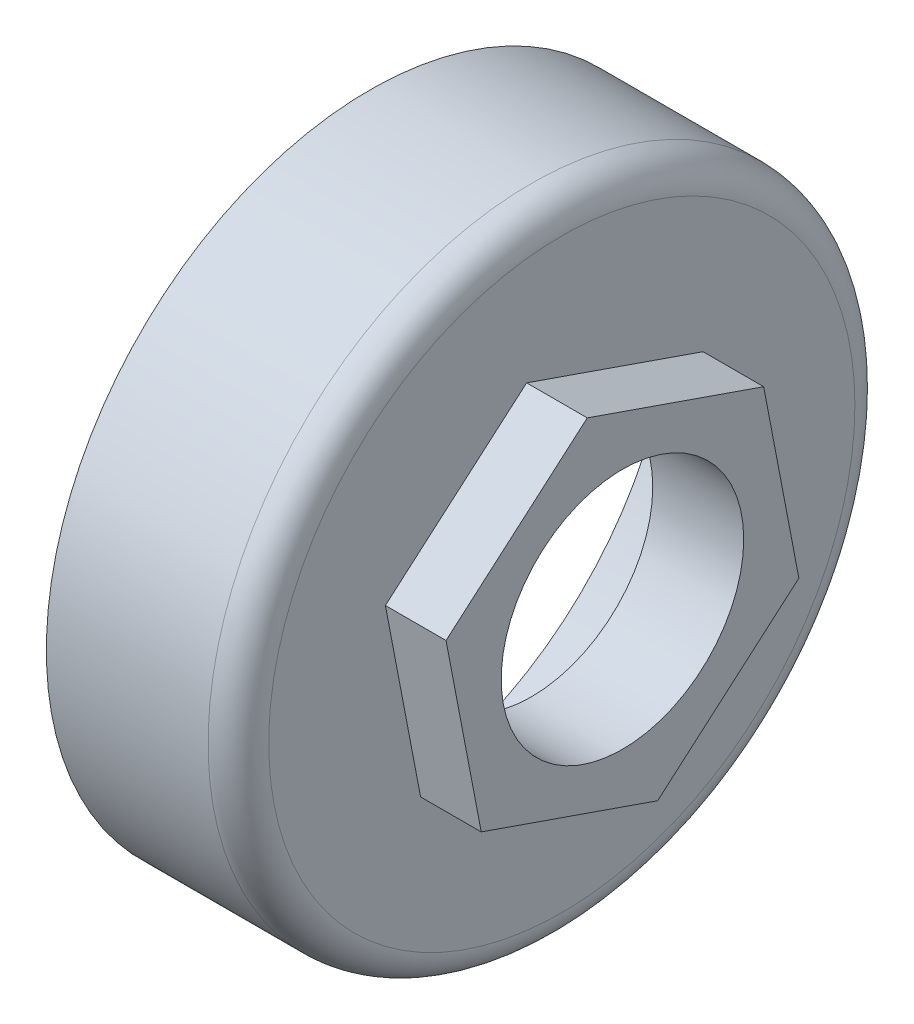
ISO-10303-21;
HEADER;
FILE_DESCRIPTION(('STEP AP214'),'2;1');
FILE_NAME('part.step','',(''),(''),'','','');
FILE_SCHEMA(('AUTOMOTIVE_DESIGN { 1 0 10303 214 1 1 1 1 }'));
ENDSEC;
DATA;
#1=APPLICATION_CONTEXT('core data for automotive mechanical design processes');
#2=APPLICATION_PROTOCOL_DEFINITION('international standard','automotive_design',2000,#1);
#3=PRODUCT_CONTEXT('',#1,'mechanical');
#4=PRODUCT('Part','Part','',(#3));
#5=PRODUCT_RELATED_PRODUCT_CATEGORY('part','',(#4));
#6=PRODUCT_DEFINITION_FORMATION('','',#4);
#7=PRODUCT_DEFINITION_CONTEXT('part definition',#1,'design');
#8=PRODUCT_DEFINITION('design','',#6,#7);
#9=PRODUCT_DEFINITION_SHAPE('','',#8);
#10=(LENGTH_UNIT() NAMED_UNIT(*) SI_UNIT(.MILLI.,.METRE.));
#11=(NAMED_UNIT(*) PLANE_ANGLE_UNIT() SI_UNIT($,.RADIAN.));
#12=(NAMED_UNIT(*) SI_UNIT($,.STERADIAN.) SOLID_ANGLE_UNIT());
#13=UNCERTAINTY_MEASURE_WITH_UNIT(LENGTH_MEASURE(1.E-05),#10,'distance_accuracy_value','');
#14=(GEOMETRIC_REPRESENTATION_CONTEXT(3) GLOBAL_UNCERTAINTY_ASSIGNED_CONTEXT((#13)) GLOBAL_UNIT_ASSIGNED_CONTEXT((#10,
#11,#12)) REPRESENTATION_CONTEXT('',''));
#15=CARTESIAN_POINT('',(0.,0.,0.));
#16=DIRECTION('',(0.,0.,1.));
#17=DIRECTION('',(1.,0.,0.));
#18=AXIS2_PLACEMENT_3D('',#15,#16,#17);
#19=CARTESIAN_POINT('',(19.,0.,0.));
#20=DIRECTION('',(1.,0.,0.));
#21=DIRECTION('',(0.,0.,-1.));
#22=AXIS2_PLACEMENT_3D('',#19,#20,#21);
#23=PLANE('',#22);
#24=CARTESIAN_POINT('',(19.,0.,0.));
#25=DIRECTION('',(1.,0.,0.));
#26=DIRECTION('',(0.,0.,-1.));
#27=AXIS2_PLACEMENT_3D('',#24,#25,#26);
#28=CIRCLE('',#27,29.);
#29=CARTESIAN_POINT('',(19.,0.,-29.));
#30=VERTEX_POINT('',#29);
#31=EDGE_CURVE('E41',#30,#30,#28,.T.);
#32=ORIENTED_EDGE('',*,*,#31,.T.);
#33=EDGE_LOOP('',(#32));
#34=FACE_BOUND('',#33,.T.);
#35=DIRECTION('',(0.,-0.982085253812499,-0.188437136053483));
#36=VECTOR('',#35,1.);
#37=CARTESIAN_POINT('',(19.,6.05712079363721,17.4540717606128));
#38=LINE('',#37,#36);
#39=CARTESIAN_POINT('',(19.,6.05712079363721,17.4540717606128));
#40=VERTEX_POINT('',#39);
#41=CARTESIAN_POINT('',(19.,-12.0871091473487,13.9726563613872));
#42=VERTEX_POINT('',#41);
#43=EDGE_CURVE('E120',#40,#42,#38,.T.);
#44=ORIENTED_EDGE('',*,*,#43,.F.);
#45=DIRECTION('',(0.,-0.65423397374495,0.756292210456971));
#46=VECTOR('',#45,1.);
#47=CARTESIAN_POINT('',(19.,18.1442299409859,3.48141539922561));
#48=LINE('',#47,#46);
#49=CARTESIAN_POINT('',(19.,18.1442299409859,3.48141539922561));
#50=VERTEX_POINT('',#49);
#51=EDGE_CURVE('E117',#50,#40,#48,.T.);
#52=ORIENTED_EDGE('',*,*,#51,.F.);
#53=DIRECTION('',(0.,0.327851280067549,0.944729346510454));
#54=VECTOR('',#53,1.);
#55=CARTESIAN_POINT('',(19.,12.0871091473487,-13.9726563613872));
#56=LINE('',#55,#54);
#57=CARTESIAN_POINT('',(19.,12.0871091473487,-13.9726563613872));
#58=VERTEX_POINT('',#57);
#59=EDGE_CURVE('E76',#58,#50,#56,.T.);
#60=ORIENTED_EDGE('',*,*,#59,.F.);
#61=DIRECTION('',(0.,0.982085253812499,0.188437136053483));
#62=VECTOR('',#61,1.);
#63=CARTESIAN_POINT('',(19.,-6.05712079363721,-17.4540717606128));
#64=LINE('',#63,#62);
#65=CARTESIAN_POINT('',(19.,-6.05712079363721,-17.4540717606128));
#66=VERTEX_POINT('',#65);
#67=EDGE_CURVE('E126',#66,#58,#64,.T.);
#68=ORIENTED_EDGE('',*,*,#67,.F.);
#69=DIRECTION('',(0.,0.65423397374495,-0.756292210456971));
#70=VECTOR('',#69,1.);
#71=CARTESIAN_POINT('',(19.,-18.1442299409859,-3.48141539922561));
#72=LINE('',#71,#70);
#73=CARTESIAN_POINT('',(19.,-18.1442299409859,-3.48141539922561));
#74=VERTEX_POINT('',#73);
#75=EDGE_CURVE('E106',#74,#66,#72,.T.);
#76=ORIENTED_EDGE('',*,*,#75,.F.);
#77=DIRECTION('',(0.,-0.327851280067549,-0.944729346510454));
#78=VECTOR('',#77,1.);
#79=CARTESIAN_POINT('',(19.,-12.0871091473487,13.9726563613872));
#80=LINE('',#79,#78);
#81=EDGE_CURVE('E123',#42,#74,#80,.T.);
#82=ORIENTED_EDGE('',*,*,#81,.F.);
#83=EDGE_LOOP('',(#44,#52,#60,#68,#76,#82));
#84=FACE_BOUND('',#83,.T.);
#85=ADVANCED_FACE('F33',(#34,#84),#23,.T.);
#86=CARTESIAN_POINT('',(19.,0.,0.));
#87=DIRECTION('',(-1.,0.,0.));
#88=DIRECTION('',(0.,0.,1.));
#89=AXIS2_PLACEMENT_3D('',#86,#87,#88);
#90=CYLINDRICAL_SURFACE('',#89,32.);
#91=CARTESIAN_POINT('',(16.,0.,0.));
#92=DIRECTION('',(1.,0.,0.));
#93=DIRECTION('',(0.,0.,-1.));
#94=AXIS2_PLACEMENT_3D('',#91,#92,#93);
#95=CIRCLE('',#94,32.);
#96=CARTESIAN_POINT('',(16.,0.,-32.));
#97=VERTEX_POINT('',#96);
#98=EDGE_CURVE('E11',#97,#97,#95,.F.);
#99=ORIENTED_EDGE('',*,*,#98,.T.);
#100=EDGE_LOOP('',(#99));
#101=FACE_BOUND('',#100,.T.);
#102=CARTESIAN_POINT('',(0.,0.,0.));
#103=DIRECTION('',(1.,0.,0.));
#104=DIRECTION('',(0.,0.,-1.));
#105=AXIS2_PLACEMENT_3D('',#102,#103,#104);
#106=CIRCLE('',#105,32.);
#107=CARTESIAN_POINT('',(0.,0.,-32.));
#108=VERTEX_POINT('',#107);
#109=EDGE_CURVE('E142',#108,#108,#106,.T.);
#110=ORIENTED_EDGE('',*,*,#109,.T.);
#111=EDGE_LOOP('',(#110));
#112=FACE_BOUND('',#111,.T.);
#113=ADVANCED_FACE('F167',(#101,#112),#90,.T.);
#114=CARTESIAN_POINT('',(0.,0.,0.));
#115=DIRECTION('',(1.,0.,0.));
#116=DIRECTION('',(0.,0.,-1.));
#117=AXIS2_PLACEMENT_3D('',#114,#115,#116);
#118=PLANE('',#117);
#119=CARTESIAN_POINT('',(0.,0.,0.));
#120=DIRECTION('',(-1.,0.,0.));
#121=DIRECTION('',(0.,0.,1.));
#122=AXIS2_PLACEMENT_3D('',#119,#120,#121);
#123=CIRCLE('',#122,30.);
#124=CARTESIAN_POINT('',(0.,0.,30.));
#125=VERTEX_POINT('',#124);
#126=EDGE_CURVE('E138',#125,#125,#123,.T.);
#127=ORIENTED_EDGE('',*,*,#126,.F.);
#128=EDGE_LOOP('',(#127));
#129=FACE_BOUND('',#128,.T.);
#130=ORIENTED_EDGE('',*,*,#109,.F.);
#131=EDGE_LOOP('',(#130));
#132=FACE_BOUND('',#131,.T.);
#133=ADVANCED_FACE('F172',(#129,#132),#118,.F.);
#134=CARTESIAN_POINT('',(16.,0.,0.));
#135=DIRECTION('',(-1.,0.,0.));
#136=DIRECTION('',(0.,0.,1.));
#137=AXIS2_PLACEMENT_3D('',#134,#135,#136);
#138=CYLINDRICAL_SURFACE('',#137,30.);
#139=CARTESIAN_POINT('',(16.,0.,0.));
#140=DIRECTION('',(-1.,0.,0.));
#141=DIRECTION('',(0.,0.,1.));
#142=AXIS2_PLACEMENT_3D('',#139,#140,#141);
#143=CIRCLE('',#142,30.);
#144=CARTESIAN_POINT('',(16.,0.,30.));
#145=VERTEX_POINT('',#144);
#146=EDGE_CURVE('E139',#145,#145,#143,.T.);
#147=ORIENTED_EDGE('',*,*,#146,.F.);
#148=EDGE_LOOP('',(#147));
#149=FACE_BOUND('',#148,.T.);
#150=ORIENTED_EDGE('',*,*,#126,.T.);
#151=EDGE_LOOP('',(#150));
#152=FACE_BOUND('',#151,.T.);
#153=ADVANCED_FACE('F162',(#149,#152),#138,.F.);
#154=CARTESIAN_POINT('',(16.,0.,0.));
#155=DIRECTION('',(-1.,0.,0.));
#156=DIRECTION('',(0.,0.,1.));
#157=AXIS2_PLACEMENT_3D('',#154,#155,#156);
#158=PLANE('',#157);
#159=CARTESIAN_POINT('',(16.,0.,0.));
#160=DIRECTION('',(-1.,0.,0.));
#161=DIRECTION('',(0.,0.,1.));
#162=AXIS2_PLACEMENT_3D('',#159,#160,#161);
#163=CIRCLE('',#162,12.);
#164=CARTESIAN_POINT('',(16.,0.,12.));
#165=VERTEX_POINT('',#164);
#166=EDGE_CURVE('E121',#165,#165,#163,.T.);
#167=ORIENTED_EDGE('',*,*,#166,.F.);
#168=EDGE_LOOP('',(#167));
#169=FACE_BOUND('',#168,.T.);
#170=ORIENTED_EDGE('',*,*,#146,.T.);
#171=EDGE_LOOP('',(#170));
#172=FACE_BOUND('',#171,.T.);
#173=ADVANCED_FACE('F153',(#169,#172),#158,.T.);
#174=CARTESIAN_POINT('',(16.,0.,0.));
#175=DIRECTION('',(1.,0.,0.));
#176=DIRECTION('',(0.,0.,-1.));
#177=AXIS2_PLACEMENT_3D('',#174,#175,#176);
#178=TOROIDAL_SURFACE('',#177,29.,3.);
#179=ORIENTED_EDGE('',*,*,#98,.F.);
#180=EDGE_LOOP('',(#179));
#181=FACE_BOUND('',#180,.T.);
#182=ORIENTED_EDGE('',*,*,#31,.F.);
#183=EDGE_LOOP('',(#182));
#184=FACE_BOUND('',#183,.T.);
#185=ADVANCED_FACE('F35',(#181,#184),#178,.T.);
#186=CARTESIAN_POINT('',(25.,18.1442299409859,3.48141539922561));
#187=DIRECTION('',(0.,-0.756292210456971,-0.65423397374495));
#188=DIRECTION('',(0.,0.65423397374495,-0.756292210456971));
#189=AXIS2_PLACEMENT_3D('',#186,#187,#188);
#190=PLANE('',#189);
#191=ORIENTED_EDGE('',*,*,#51,.T.);
#192=DIRECTION('',(-1.,0.,0.));
#193=VECTOR('',#192,1.);
#194=CARTESIAN_POINT('',(25.,6.05712079363721,17.4540717606128));
#195=LINE('',#194,#193);
#196=CARTESIAN_POINT('',(25.,6.05712079363721,17.4540717606128));
#197=VERTEX_POINT('',#196);
#198=EDGE_CURVE('E136',#197,#40,#195,.T.);
#199=ORIENTED_EDGE('',*,*,#198,.F.);
#200=DIRECTION('',(0.,-0.65423397374495,0.756292210456971));
#201=VECTOR('',#200,1.);
#202=CARTESIAN_POINT('',(25.,18.1442299409859,3.48141539922561));
#203=LINE('',#202,#201);
#204=CARTESIAN_POINT('',(25.,18.1442299409859,3.48141539922561));
#205=VERTEX_POINT('',#204);
#206=EDGE_CURVE('E129',#205,#197,#203,.T.);
#207=ORIENTED_EDGE('',*,*,#206,.F.);
#208=DIRECTION('',(-1.,0.,0.));
#209=VECTOR('',#208,1.);
#210=CARTESIAN_POINT('',(25.,18.1442299409859,3.48141539922561));
#211=LINE('',#210,#209);
#212=EDGE_CURVE('E113',#205,#50,#211,.T.);
#213=ORIENTED_EDGE('',*,*,#212,.T.);
#214=EDGE_LOOP('',(#191,#199,#207,#213));
#215=FACE_BOUND('',#214,.T.);
#216=ADVANCED_FACE('F152',(#215),#190,.F.);
#217=CARTESIAN_POINT('',(25.,6.05712079363721,17.4540717606128));
#218=DIRECTION('',(0.,0.188437136053483,-0.982085253812499));
#219=DIRECTION('',(0.,0.9820852538125,0.188437136053483));
#220=AXIS2_PLACEMENT_3D('',#217,#218,#219);
#221=PLANE('',#220);
#222=ORIENTED_EDGE('',*,*,#43,.T.);
#223=DIRECTION('',(-1.,0.,0.));
#224=VECTOR('',#223,1.);
#225=CARTESIAN_POINT('',(25.,-12.0871091473487,13.9726563613872));
#226=LINE('',#225,#224);
#227=CARTESIAN_POINT('',(25.,-12.0871091473487,13.9726563613872));
#228=VERTEX_POINT('',#227);
#229=EDGE_CURVE('E133',#228,#42,#226,.T.);
#230=ORIENTED_EDGE('',*,*,#229,.F.);
#231=DIRECTION('',(0.,-0.982085253812499,-0.188437136053483));
#232=VECTOR('',#231,1.);
#233=CARTESIAN_POINT('',(25.,6.05712079363721,17.4540717606128));
#234=LINE('',#233,#232);
#235=EDGE_CURVE('E84',#197,#228,#234,.T.);
#236=ORIENTED_EDGE('',*,*,#235,.F.);
#237=ORIENTED_EDGE('',*,*,#198,.T.);
#238=EDGE_LOOP('',(#222,#230,#236,#237));
#239=FACE_BOUND('',#238,.T.);
#240=ADVANCED_FACE('F159',(#239),#221,.F.);
#241=CARTESIAN_POINT('',(25.,-12.0871091473487,13.9726563613872));
#242=DIRECTION('',(0.,0.944729346510454,-0.327851280067549));
#243=DIRECTION('',(0.,0.327851280067549,0.944729346510454));
#244=AXIS2_PLACEMENT_3D('',#241,#242,#243);
#245=PLANE('',#244);
#246=ORIENTED_EDGE('',*,*,#81,.T.);
#247=DIRECTION('',(-1.,0.,0.));
#248=VECTOR('',#247,1.);
#249=CARTESIAN_POINT('',(25.,-18.1442299409859,-3.48141539922561));
#250=LINE('',#249,#248);
#251=CARTESIAN_POINT('',(25.,-18.1442299409859,-3.48141539922561));
#252=VERTEX_POINT('',#251);
#253=EDGE_CURVE('E109',#252,#74,#250,.T.);
#254=ORIENTED_EDGE('',*,*,#253,.F.);
#255=DIRECTION('',(0.,-0.327851280067549,-0.944729346510454));
#256=VECTOR('',#255,1.);
#257=CARTESIAN_POINT('',(25.,-12.0871091473487,13.9726563613872));
#258=LINE('',#257,#256);
#259=EDGE_CURVE('E97',#228,#252,#258,.T.);
#260=ORIENTED_EDGE('',*,*,#259,.F.);
#261=ORIENTED_EDGE('',*,*,#229,.T.);
#262=EDGE_LOOP('',(#246,#254,#260,#261));
#263=FACE_BOUND('',#262,.T.);
#264=ADVANCED_FACE('F234',(#263),#245,.F.);
#265=CARTESIAN_POINT('',(25.,-18.1442299409859,-3.48141539922561));
#266=DIRECTION('',(0.,0.756292210456971,0.65423397374495));
#267=DIRECTION('',(0.,-0.65423397374495,0.756292210456971));
#268=AXIS2_PLACEMENT_3D('',#265,#266,#267);
#269=PLANE('',#268);
#270=ORIENTED_EDGE('',*,*,#75,.T.);
#271=DIRECTION('',(-1.,0.,0.));
#272=VECTOR('',#271,1.);
#273=CARTESIAN_POINT('',(25.,-6.05712079363721,-17.4540717606128));
#274=LINE('',#273,#272);
#275=CARTESIAN_POINT('',(25.,-6.05712079363721,-17.4540717606128));
#276=VERTEX_POINT('',#275);
#277=EDGE_CURVE('E103',#276,#66,#274,.T.);
#278=ORIENTED_EDGE('',*,*,#277,.F.);
#279=DIRECTION('',(0.,0.65423397374495,-0.756292210456971));
#280=VECTOR('',#279,1.);
#281=CARTESIAN_POINT('',(25.,-18.1442299409859,-3.48141539922561));
#282=LINE('',#281,#280);
#283=EDGE_CURVE('E91',#252,#276,#282,.T.);
#284=ORIENTED_EDGE('',*,*,#283,.F.);
#285=ORIENTED_EDGE('',*,*,#253,.T.);
#286=EDGE_LOOP('',(#270,#278,#284,#285));
#287=FACE_BOUND('',#286,.T.);
#288=ADVANCED_FACE('F104',(#287),#269,.F.);
#289=CARTESIAN_POINT('',(25.,-6.05712079363721,-17.4540717606128));
#290=DIRECTION('',(0.,-0.188437136053482,0.982085253812499));
#291=DIRECTION('',(0.,-0.9820852538125,-0.188437136053483));
#292=AXIS2_PLACEMENT_3D('',#289,#290,#291);
#293=PLANE('',#292);
#294=ORIENTED_EDGE('',*,*,#67,.T.);
#295=DIRECTION('',(-1.,0.,0.));
#296=VECTOR('',#295,1.);
#297=CARTESIAN_POINT('',(25.,12.0871091473487,-13.9726563613872));
#298=LINE('',#297,#296);
#299=CARTESIAN_POINT('',(25.,12.0871091473487,-13.9726563613872));
#300=VERTEX_POINT('',#299);
#301=EDGE_CURVE('E48',#300,#58,#298,.T.);
#302=ORIENTED_EDGE('',*,*,#301,.F.);
#303=DIRECTION('',(0.,0.982085253812499,0.188437136053483));
#304=VECTOR('',#303,1.);
#305=CARTESIAN_POINT('',(25.,-6.05712079363721,-17.4540717606128));
#306=LINE('',#305,#304);
#307=EDGE_CURVE('E95',#276,#300,#306,.T.);
#308=ORIENTED_EDGE('',*,*,#307,.F.);
#309=ORIENTED_EDGE('',*,*,#277,.T.);
#310=EDGE_LOOP('',(#294,#302,#308,#309));
#311=FACE_BOUND('',#310,.T.);
#312=ADVANCED_FACE('F111',(#311),#293,.F.);
#313=CARTESIAN_POINT('',(25.,12.0871091473487,-13.9726563613872));
#314=DIRECTION('',(0.,-0.944729346510454,0.327851280067549));
#315=DIRECTION('',(0.,-0.327851280067549,-0.944729346510454));
#316=AXIS2_PLACEMENT_3D('',#313,#314,#315);
#317=PLANE('',#316);
#318=ORIENTED_EDGE('',*,*,#59,.T.);
#319=ORIENTED_EDGE('',*,*,#212,.F.);
#320=DIRECTION('',(0.,0.327851280067549,0.944729346510454));
#321=VECTOR('',#320,1.);
#322=CARTESIAN_POINT('',(25.,12.0871091473487,-13.9726563613872));
#323=LINE('',#322,#321);
#324=EDGE_CURVE('E56',#300,#205,#323,.T.);
#325=ORIENTED_EDGE('',*,*,#324,.F.);
#326=ORIENTED_EDGE('',*,*,#301,.T.);
#327=EDGE_LOOP('',(#318,#319,#325,#326));
#328=FACE_BOUND('',#327,.T.);
#329=ADVANCED_FACE('F203',(#328),#317,.F.);
#330=CARTESIAN_POINT('',(25.,0.,0.));
#331=DIRECTION('',(1.,0.,0.));
#332=DIRECTION('',(0.,0.,-1.));
#333=AXIS2_PLACEMENT_3D('',#330,#331,#332);
#334=PLANE('',#333);
#335=CARTESIAN_POINT('',(25.,0.,0.));
#336=DIRECTION('',(1.,0.,0.));
#337=DIRECTION('',(0.,0.,-1.));
#338=AXIS2_PLACEMENT_3D('',#335,#336,#337);
#339=CIRCLE('',#338,12.);
#340=CARTESIAN_POINT('',(25.,0.,-12.));
#341=VERTEX_POINT('',#340);
#342=EDGE_CURVE('E250',#341,#341,#339,.T.);
#343=ORIENTED_EDGE('',*,*,#342,.F.);
#344=EDGE_LOOP('',(#343));
#345=FACE_BOUND('',#344,.T.);
#346=ORIENTED_EDGE('',*,*,#206,.T.);
#347=ORIENTED_EDGE('',*,*,#235,.T.);
#348=ORIENTED_EDGE('',*,*,#259,.T.);
#349=ORIENTED_EDGE('',*,*,#283,.T.);
#350=ORIENTED_EDGE('',*,*,#307,.T.);
#351=ORIENTED_EDGE('',*,*,#324,.T.);
#352=EDGE_LOOP('',(#346,#347,#348,#349,#350,#351));
#353=FACE_BOUND('',#352,.T.);
#354=ADVANCED_FACE('F93',(#345,#353),#334,.T.);
#355=CARTESIAN_POINT('',(0.,0.,0.));
#356=DIRECTION('',(1.,0.,0.));
#357=DIRECTION('',(0.,0.,-1.));
#358=AXIS2_PLACEMENT_3D('',#355,#356,#357);
#359=CYLINDRICAL_SURFACE('',#358,12.);
#360=ORIENTED_EDGE('',*,*,#166,.T.);
#361=EDGE_LOOP('',(#360));
#362=FACE_BOUND('',#361,.T.);
#363=ORIENTED_EDGE('',*,*,#342,.T.);
#364=EDGE_LOOP('',(#363));
#365=FACE_BOUND('',#364,.T.);
#366=ADVANCED_FACE('F212',(#362,#365),#359,.F.);
#367=CLOSED_SHELL('',(#85,#113,#133,#153,#173,#185,#216,#240,#264,#288,#312,#329,#354,#366));
#368=MANIFOLD_SOLID_BREP('B2',#367);
#369=ADVANCED_BREP_SHAPE_REPRESENTATION('',(#18,#368),#14);
#370=SHAPE_DEFINITION_REPRESENTATION(#9,#369);
ENDSEC;
END-ISO-10303-21;
